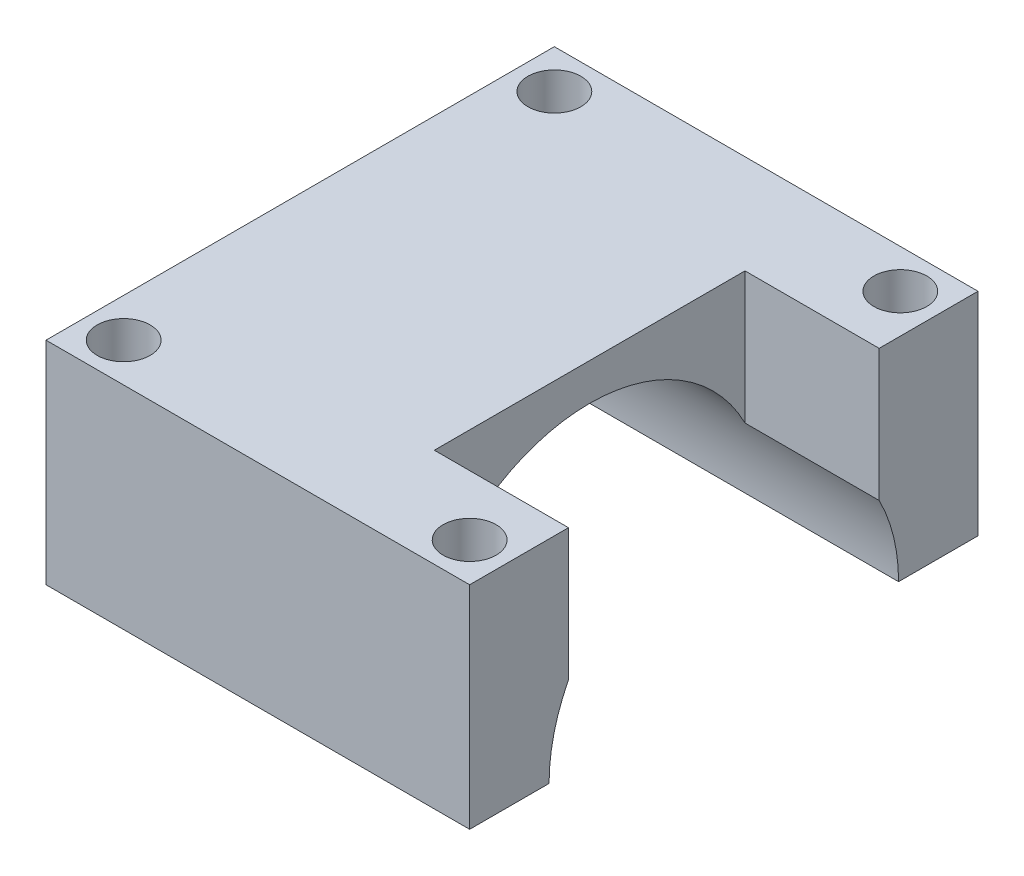
ISO-10303-21;
HEADER;
FILE_DESCRIPTION(('STEP AP214'),'2;1');
FILE_NAME('part.step','',(''),(''),'','','');
FILE_SCHEMA(('AUTOMOTIVE_DESIGN { 1 0 10303 214 1 1 1 1 }'));
ENDSEC;
DATA;
#1=APPLICATION_CONTEXT('core data for automotive mechanical design processes');
#2=APPLICATION_PROTOCOL_DEFINITION('international standard','automotive_design',2000,#1);
#3=PRODUCT_CONTEXT('',#1,'mechanical');
#4=PRODUCT('Part','Part','',(#3));
#5=PRODUCT_RELATED_PRODUCT_CATEGORY('part','',(#4));
#6=PRODUCT_DEFINITION_FORMATION('','',#4);
#7=PRODUCT_DEFINITION_CONTEXT('part definition',#1,'design');
#8=PRODUCT_DEFINITION('design','',#6,#7);
#9=PRODUCT_DEFINITION_SHAPE('','',#8);
#10=(LENGTH_UNIT() NAMED_UNIT(*) SI_UNIT(.MILLI.,.METRE.));
#11=(NAMED_UNIT(*) PLANE_ANGLE_UNIT() SI_UNIT($,.RADIAN.));
#12=(NAMED_UNIT(*) SI_UNIT($,.STERADIAN.) SOLID_ANGLE_UNIT());
#13=UNCERTAINTY_MEASURE_WITH_UNIT(LENGTH_MEASURE(1.E-05),#10,'distance_accuracy_value','');
#14=(GEOMETRIC_REPRESENTATION_CONTEXT(3) GLOBAL_UNCERTAINTY_ASSIGNED_CONTEXT((#13)) GLOBAL_UNIT_ASSIGNED_CONTEXT((#10,
#11,#12)) REPRESENTATION_CONTEXT('',''));
#15=CARTESIAN_POINT('',(0.,0.,0.));
#16=DIRECTION('',(0.,0.,1.));
#17=DIRECTION('',(1.,0.,0.));
#18=AXIS2_PLACEMENT_3D('',#15,#16,#17);
#19=CARTESIAN_POINT('',(15.,30.,18.));
#20=DIRECTION('',(-1.,0.,0.));
#21=DIRECTION('',(0.,0.,1.));
#22=AXIS2_PLACEMENT_3D('',#19,#20,#21);
#23=PLANE('',#22);
#24=DIRECTION('',(0.,0.,-1.));
#25=VECTOR('',#24,1.);
#26=CARTESIAN_POINT('',(15.,30.,18.));
#27=LINE('',#26,#25);
#28=CARTESIAN_POINT('',(15.,30.,-11.));
#29=VERTEX_POINT('',#28);
#30=CARTESIAN_POINT('',(15.,30.,-18.));
#31=VERTEX_POINT('',#30);
#32=EDGE_CURVE('E223',#29,#31,#27,.T.);
#33=ORIENTED_EDGE('',*,*,#32,.F.);
#34=DIRECTION('',(0.,1.,0.));
#35=VECTOR('',#34,1.);
#36=CARTESIAN_POINT('',(15.,20.,-11.));
#37=LINE('',#36,#35);
#38=CARTESIAN_POINT('',(15.,20.6692702352243,-11.));
#39=VERTEX_POINT('',#38);
#40=EDGE_CURVE('E142',#39,#29,#37,.T.);
#41=ORIENTED_EDGE('',*,*,#40,.F.);
#42=CARTESIAN_POINT('',(15.,15.,0.));
#43=DIRECTION('',(1.,0.,0.));
#44=DIRECTION('',(0.,0.,-1.));
#45=AXIS2_PLACEMENT_3D('',#42,#43,#44);
#46=CIRCLE('',#45,12.375);
#47=CARTESIAN_POINT('',(15.,15.,-12.375));
#48=VERTEX_POINT('',#47);
#49=EDGE_CURVE('E214',#48,#39,#46,.T.);
#50=ORIENTED_EDGE('',*,*,#49,.F.);
#51=DIRECTION('',(0.,0.,1.));
#52=VECTOR('',#51,1.);
#53=CARTESIAN_POINT('',(15.,15.,18.));
#54=LINE('',#53,#52);
#55=CARTESIAN_POINT('',(15.,15.,-18.));
#56=VERTEX_POINT('',#55);
#57=EDGE_CURVE('E168',#56,#48,#54,.T.);
#58=ORIENTED_EDGE('',*,*,#57,.F.);
#59=DIRECTION('',(0.,-1.,0.));
#60=VECTOR('',#59,1.);
#61=CARTESIAN_POINT('',(15.,30.,-18.));
#62=LINE('',#61,#60);
#63=EDGE_CURVE('E244',#31,#56,#62,.T.);
#64=ORIENTED_EDGE('',*,*,#63,.F.);
#65=EDGE_LOOP('',(#33,#41,#50,#58,#64));
#66=FACE_BOUND('',#65,.T.);
#67=ADVANCED_FACE('F49',(#66),#23,.F.);
#68=CARTESIAN_POINT('',(15.,20.6692702352243,11.));
#69=VERTEX_POINT('',#68);
#70=CARTESIAN_POINT('',(15.,15.,12.375));
#71=VERTEX_POINT('',#70);
#72=EDGE_CURVE('E213',#69,#71,#46,.T.);
#73=ORIENTED_EDGE('',*,*,#72,.F.);
#74=DIRECTION('',(0.,1.,0.));
#75=VECTOR('',#74,1.);
#76=CARTESIAN_POINT('',(15.,20.,11.));
#77=LINE('',#76,#75);
#78=CARTESIAN_POINT('',(15.,30.,11.));
#79=VERTEX_POINT('',#78);
#80=EDGE_CURVE('E157',#69,#79,#77,.T.);
#81=ORIENTED_EDGE('',*,*,#80,.T.);
#82=CARTESIAN_POINT('',(15.,30.,18.));
#83=VERTEX_POINT('',#82);
#84=EDGE_CURVE('E219',#83,#79,#27,.T.);
#85=ORIENTED_EDGE('',*,*,#84,.F.);
#86=DIRECTION('',(0.,-1.,0.));
#87=VECTOR('',#86,1.);
#88=CARTESIAN_POINT('',(15.,30.,18.));
#89=LINE('',#88,#87);
#90=CARTESIAN_POINT('',(15.,15.,18.));
#91=VERTEX_POINT('',#90);
#92=EDGE_CURVE('E232',#83,#91,#89,.T.);
#93=ORIENTED_EDGE('',*,*,#92,.T.);
#94=EDGE_CURVE('E156',#71,#91,#54,.T.);
#95=ORIENTED_EDGE('',*,*,#94,.F.);
#96=EDGE_LOOP('',(#73,#81,#85,#93,#95));
#97=FACE_BOUND('',#96,.T.);
#98=ADVANCED_FACE('F51',(#97),#23,.F.);
#99=CARTESIAN_POINT('',(-15.,30.,-18.));
#100=DIRECTION('',(0.,0.,1.));
#101=DIRECTION('',(1.,0.,0.));
#102=AXIS2_PLACEMENT_3D('',#99,#100,#101);
#103=PLANE('',#102);
#104=ORIENTED_EDGE('',*,*,#63,.T.);
#105=DIRECTION('',(1.,0.,0.));
#106=VECTOR('',#105,1.);
#107=CARTESIAN_POINT('',(-15.,15.,-18.));
#108=LINE('',#107,#106);
#109=CARTESIAN_POINT('',(-15.,15.,-18.));
#110=VERTEX_POINT('',#109);
#111=EDGE_CURVE('E171',#110,#56,#108,.T.);
#112=ORIENTED_EDGE('',*,*,#111,.F.);
#113=DIRECTION('',(0.,-1.,0.));
#114=VECTOR('',#113,1.);
#115=CARTESIAN_POINT('',(-15.,30.,-18.));
#116=LINE('',#115,#114);
#117=CARTESIAN_POINT('',(-15.,30.,-18.));
#118=VERTEX_POINT('',#117);
#119=EDGE_CURVE('E240',#118,#110,#116,.T.);
#120=ORIENTED_EDGE('',*,*,#119,.F.);
#121=DIRECTION('',(-1.,0.,0.));
#122=VECTOR('',#121,1.);
#123=CARTESIAN_POINT('',(-15.,30.,-18.));
#124=LINE('',#123,#122);
#125=EDGE_CURVE('E222',#31,#118,#124,.T.);
#126=ORIENTED_EDGE('',*,*,#125,.F.);
#127=EDGE_LOOP('',(#104,#112,#120,#126));
#128=FACE_BOUND('',#127,.T.);
#129=ADVANCED_FACE('F286',(#128),#103,.F.);
#130=CARTESIAN_POINT('',(-15.,30.,18.));
#131=DIRECTION('',(1.,0.,0.));
#132=DIRECTION('',(0.,0.,-1.));
#133=AXIS2_PLACEMENT_3D('',#130,#131,#132);
#134=PLANE('',#133);
#135=ORIENTED_EDGE('',*,*,#119,.T.);
#136=DIRECTION('',(0.,0.,1.));
#137=VECTOR('',#136,1.);
#138=CARTESIAN_POINT('',(-15.,15.,18.));
#139=LINE('',#138,#137);
#140=CARTESIAN_POINT('',(-15.,15.,-12.375));
#141=VERTEX_POINT('',#140);
#142=EDGE_CURVE('E163',#110,#141,#139,.T.);
#143=ORIENTED_EDGE('',*,*,#142,.T.);
#144=CARTESIAN_POINT('',(-15.,15.,0.));
#145=DIRECTION('',(1.,0.,0.));
#146=DIRECTION('',(0.,0.,-1.));
#147=AXIS2_PLACEMENT_3D('',#144,#145,#146);
#148=CIRCLE('',#147,12.375);
#149=CARTESIAN_POINT('',(-15.,15.,12.375));
#150=VERTEX_POINT('',#149);
#151=EDGE_CURVE('E218',#141,#150,#148,.T.);
#152=ORIENTED_EDGE('',*,*,#151,.T.);
#153=CARTESIAN_POINT('',(-15.,15.,18.));
#154=VERTEX_POINT('',#153);
#155=EDGE_CURVE('E73',#150,#154,#139,.T.);
#156=ORIENTED_EDGE('',*,*,#155,.T.);
#157=DIRECTION('',(0.,-1.,0.));
#158=VECTOR('',#157,1.);
#159=CARTESIAN_POINT('',(-15.,30.,18.));
#160=LINE('',#159,#158);
#161=CARTESIAN_POINT('',(-15.,30.,18.));
#162=VERTEX_POINT('',#161);
#163=EDGE_CURVE('E236',#162,#154,#160,.T.);
#164=ORIENTED_EDGE('',*,*,#163,.F.);
#165=DIRECTION('',(0.,0.,1.));
#166=VECTOR('',#165,1.);
#167=CARTESIAN_POINT('',(-15.,30.,18.));
#168=LINE('',#167,#166);
#169=EDGE_CURVE('E226',#118,#162,#168,.T.);
#170=ORIENTED_EDGE('',*,*,#169,.F.);
#171=EDGE_LOOP('',(#135,#143,#152,#156,#164,#170));
#172=FACE_BOUND('',#171,.T.);
#173=ADVANCED_FACE('F277',(#172),#134,.F.);
#174=CARTESIAN_POINT('',(-15.,30.,18.));
#175=DIRECTION('',(0.,0.,-1.));
#176=DIRECTION('',(-1.,0.,0.));
#177=AXIS2_PLACEMENT_3D('',#174,#175,#176);
#178=PLANE('',#177);
#179=ORIENTED_EDGE('',*,*,#163,.T.);
#180=DIRECTION('',(1.,0.,0.));
#181=VECTOR('',#180,1.);
#182=CARTESIAN_POINT('',(-15.,15.,18.));
#183=LINE('',#182,#181);
#184=EDGE_CURVE('E167',#154,#91,#183,.T.);
#185=ORIENTED_EDGE('',*,*,#184,.T.);
#186=ORIENTED_EDGE('',*,*,#92,.F.);
#187=DIRECTION('',(1.,0.,0.));
#188=VECTOR('',#187,1.);
#189=CARTESIAN_POINT('',(-15.,30.,18.));
#190=LINE('',#189,#188);
#191=EDGE_CURVE('E229',#162,#83,#190,.T.);
#192=ORIENTED_EDGE('',*,*,#191,.F.);
#193=EDGE_LOOP('',(#179,#185,#186,#192));
#194=FACE_BOUND('',#193,.T.);
#195=ADVANCED_FACE('F270',(#194),#178,.F.);
#196=CARTESIAN_POINT('',(0.,30.,0.));
#197=DIRECTION('',(0.,-1.,0.));
#198=DIRECTION('',(0.,0.,-1.));
#199=AXIS2_PLACEMENT_3D('',#196,#197,#198);
#200=PLANE('',#199);
#201=CARTESIAN_POINT('',(12.25,30.,-15.25));
#202=DIRECTION('',(0.,1.,0.));
#203=DIRECTION('',(0.,0.,-1.));
#204=AXIS2_PLACEMENT_3D('',#201,#202,#203);
#205=CIRCLE('',#204,1.875);
#206=CARTESIAN_POINT('',(12.25,30.,-17.125));
#207=VERTEX_POINT('',#206);
#208=EDGE_CURVE('E197',#207,#207,#205,.T.);
#209=ORIENTED_EDGE('',*,*,#208,.F.);
#210=EDGE_LOOP('',(#209));
#211=FACE_BOUND('',#210,.T.);
#212=CARTESIAN_POINT('',(12.25,30.,15.25));
#213=DIRECTION('',(0.,1.,0.));
#214=DIRECTION('',(0.,0.,1.));
#215=AXIS2_PLACEMENT_3D('',#212,#213,#214);
#216=CIRCLE('',#215,1.875);
#217=CARTESIAN_POINT('',(12.25,30.,17.125));
#218=VERTEX_POINT('',#217);
#219=EDGE_CURVE('E203',#218,#218,#216,.T.);
#220=ORIENTED_EDGE('',*,*,#219,.F.);
#221=EDGE_LOOP('',(#220));
#222=FACE_BOUND('',#221,.T.);
#223=CARTESIAN_POINT('',(-12.25,30.,15.25));
#224=DIRECTION('',(0.,1.,0.));
#225=DIRECTION('',(0.,0.,-1.));
#226=AXIS2_PLACEMENT_3D('',#223,#224,#225);
#227=CIRCLE('',#226,1.875);
#228=CARTESIAN_POINT('',(-12.25,30.,13.375));
#229=VERTEX_POINT('',#228);
#230=EDGE_CURVE('E198',#229,#229,#227,.T.);
#231=ORIENTED_EDGE('',*,*,#230,.F.);
#232=EDGE_LOOP('',(#231));
#233=FACE_BOUND('',#232,.T.);
#234=CARTESIAN_POINT('',(-12.25,30.,-15.25));
#235=DIRECTION('',(0.,1.,0.));
#236=DIRECTION('',(0.,0.,1.));
#237=AXIS2_PLACEMENT_3D('',#234,#235,#236);
#238=CIRCLE('',#237,1.875);
#239=CARTESIAN_POINT('',(-12.25,30.,-13.375));
#240=VERTEX_POINT('',#239);
#241=EDGE_CURVE('E202',#240,#240,#238,.T.);
#242=ORIENTED_EDGE('',*,*,#241,.F.);
#243=EDGE_LOOP('',(#242));
#244=FACE_BOUND('',#243,.T.);
#245=DIRECTION('',(0.,0.,1.));
#246=VECTOR('',#245,1.);
#247=CARTESIAN_POINT('',(5.5,30.,11.));
#248=LINE('',#247,#246);
#249=CARTESIAN_POINT('',(5.5,30.,-11.));
#250=VERTEX_POINT('',#249);
#251=CARTESIAN_POINT('',(5.5,30.,11.));
#252=VERTEX_POINT('',#251);
#253=EDGE_CURVE('E130',#250,#252,#248,.T.);
#254=ORIENTED_EDGE('',*,*,#253,.F.);
#255=DIRECTION('',(-1.,0.,0.));
#256=VECTOR('',#255,1.);
#257=CARTESIAN_POINT('',(5.5,30.,-11.));
#258=LINE('',#257,#256);
#259=EDGE_CURVE('E139',#29,#250,#258,.T.);
#260=ORIENTED_EDGE('',*,*,#259,.F.);
#261=ORIENTED_EDGE('',*,*,#32,.T.);
#262=ORIENTED_EDGE('',*,*,#125,.T.);
#263=ORIENTED_EDGE('',*,*,#169,.T.);
#264=ORIENTED_EDGE('',*,*,#191,.T.);
#265=ORIENTED_EDGE('',*,*,#84,.T.);
#266=DIRECTION('',(1.,0.,0.));
#267=VECTOR('',#266,1.);
#268=CARTESIAN_POINT('',(5.5,30.,11.));
#269=LINE('',#268,#267);
#270=EDGE_CURVE('E136',#252,#79,#269,.T.);
#271=ORIENTED_EDGE('',*,*,#270,.F.);
#272=EDGE_LOOP('',(#254,#260,#261,#262,#263,#264,#265,#271));
#273=FACE_BOUND('',#272,.T.);
#274=ADVANCED_FACE('F147',(#211,#222,#233,#244,#273),#200,.F.);
#275=CARTESIAN_POINT('',(-25.,15.,0.));
#276=DIRECTION('',(1.,0.,0.));
#277=DIRECTION('',(0.,0.,-1.));
#278=AXIS2_PLACEMENT_3D('',#275,#276,#277);
#279=CYLINDRICAL_SURFACE('',#278,12.375);
#280=ORIENTED_EDGE('',*,*,#49,.T.);
#281=DIRECTION('',(1.,0.,0.));
#282=VECTOR('',#281,1.);
#283=CARTESIAN_POINT('',(-25.,20.6692702352243,-11.));
#284=LINE('',#283,#282);
#285=CARTESIAN_POINT('',(5.5,20.6692702352243,-11.));
#286=VERTEX_POINT('',#285);
#287=EDGE_CURVE('E11',#39,#286,#284,.F.);
#288=ORIENTED_EDGE('',*,*,#287,.T.);
#289=CARTESIAN_POINT('',(5.5,15.,0.));
#290=DIRECTION('',(-1.,0.,0.));
#291=DIRECTION('',(0.,0.,1.));
#292=AXIS2_PLACEMENT_3D('',#289,#290,#291);
#293=CIRCLE('',#292,12.375);
#294=CARTESIAN_POINT('',(5.5,20.6692702352243,11.));
#295=VERTEX_POINT('',#294);
#296=EDGE_CURVE('E133',#286,#295,#293,.F.);
#297=ORIENTED_EDGE('',*,*,#296,.T.);
#298=DIRECTION('',(1.,0.,0.));
#299=VECTOR('',#298,1.);
#300=CARTESIAN_POINT('',(-25.,20.6692702352243,11.));
#301=LINE('',#300,#299);
#302=EDGE_CURVE('E58',#295,#69,#301,.T.);
#303=ORIENTED_EDGE('',*,*,#302,.T.);
#304=ORIENTED_EDGE('',*,*,#72,.T.);
#305=DIRECTION('',(1.,0.,0.));
#306=VECTOR('',#305,1.);
#307=CARTESIAN_POINT('',(-25.,15.,12.375));
#308=LINE('',#307,#306);
#309=EDGE_CURVE('E194',#71,#150,#308,.F.);
#310=ORIENTED_EDGE('',*,*,#309,.T.);
#311=ORIENTED_EDGE('',*,*,#151,.F.);
#312=DIRECTION('',(1.,0.,0.));
#313=VECTOR('',#312,1.);
#314=CARTESIAN_POINT('',(-25.,15.,-12.375));
#315=LINE('',#314,#313);
#316=EDGE_CURVE('E190',#141,#48,#315,.T.);
#317=ORIENTED_EDGE('',*,*,#316,.T.);
#318=EDGE_LOOP('',(#280,#288,#297,#303,#304,#310,#311,#317));
#319=FACE_BOUND('',#318,.T.);
#320=ADVANCED_FACE('F259',(#319),#279,.F.);
#321=CARTESIAN_POINT('',(-12.25,-10.,-15.25));
#322=DIRECTION('',(0.,1.,0.));
#323=DIRECTION('',(0.,0.,1.));
#324=AXIS2_PLACEMENT_3D('',#321,#322,#323);
#325=CYLINDRICAL_SURFACE('',#324,1.875);
#326=CARTESIAN_POINT('',(-12.25,15.,-15.25));
#327=DIRECTION('',(0.,1.,0.));
#328=DIRECTION('',(0.,0.,1.));
#329=AXIS2_PLACEMENT_3D('',#326,#327,#328);
#330=CIRCLE('',#329,1.875);
#331=CARTESIAN_POINT('',(-12.25,15.,-13.375));
#332=VERTEX_POINT('',#331);
#333=EDGE_CURVE('E186',#332,#332,#330,.F.);
#334=ORIENTED_EDGE('',*,*,#333,.T.);
#335=EDGE_LOOP('',(#334));
#336=FACE_BOUND('',#335,.T.);
#337=ORIENTED_EDGE('',*,*,#241,.T.);
#338=EDGE_LOOP('',(#337));
#339=FACE_BOUND('',#338,.T.);
#340=ADVANCED_FACE('F324',(#336,#339),#325,.F.);
#341=CARTESIAN_POINT('',(-12.25,-10.,15.25));
#342=DIRECTION('',(0.,1.,0.));
#343=DIRECTION('',(0.,0.,1.));
#344=AXIS2_PLACEMENT_3D('',#341,#342,#343);
#345=CYLINDRICAL_SURFACE('',#344,1.875);
#346=CARTESIAN_POINT('',(-12.25,15.,15.25));
#347=DIRECTION('',(0.,1.,0.));
#348=DIRECTION('',(0.,0.,1.));
#349=AXIS2_PLACEMENT_3D('',#346,#347,#348);
#350=CIRCLE('',#349,1.875);
#351=CARTESIAN_POINT('',(-12.25,15.,17.125));
#352=VERTEX_POINT('',#351);
#353=EDGE_CURVE('E182',#352,#352,#350,.F.);
#354=ORIENTED_EDGE('',*,*,#353,.T.);
#355=EDGE_LOOP('',(#354));
#356=FACE_BOUND('',#355,.T.);
#357=ORIENTED_EDGE('',*,*,#230,.T.);
#358=EDGE_LOOP('',(#357));
#359=FACE_BOUND('',#358,.T.);
#360=ADVANCED_FACE('F326',(#356,#359),#345,.F.);
#361=CARTESIAN_POINT('',(12.25,-10.,15.25));
#362=DIRECTION('',(0.,1.,0.));
#363=DIRECTION('',(0.,0.,1.));
#364=AXIS2_PLACEMENT_3D('',#361,#362,#363);
#365=CYLINDRICAL_SURFACE('',#364,1.875);
#366=CARTESIAN_POINT('',(12.25,15.,15.25));
#367=DIRECTION('',(0.,1.,0.));
#368=DIRECTION('',(0.,0.,1.));
#369=AXIS2_PLACEMENT_3D('',#366,#367,#368);
#370=CIRCLE('',#369,1.875);
#371=CARTESIAN_POINT('',(12.25,15.,17.125));
#372=VERTEX_POINT('',#371);
#373=EDGE_CURVE('E178',#372,#372,#370,.F.);
#374=ORIENTED_EDGE('',*,*,#373,.T.);
#375=EDGE_LOOP('',(#374));
#376=FACE_BOUND('',#375,.T.);
#377=ORIENTED_EDGE('',*,*,#219,.T.);
#378=EDGE_LOOP('',(#377));
#379=FACE_BOUND('',#378,.T.);
#380=ADVANCED_FACE('F298',(#376,#379),#365,.F.);
#381=CARTESIAN_POINT('',(12.25,-10.,-15.25));
#382=DIRECTION('',(0.,1.,0.));
#383=DIRECTION('',(0.,0.,1.));
#384=AXIS2_PLACEMENT_3D('',#381,#382,#383);
#385=CYLINDRICAL_SURFACE('',#384,1.875);
#386=CARTESIAN_POINT('',(12.25,15.,-15.25));
#387=DIRECTION('',(0.,1.,0.));
#388=DIRECTION('',(0.,0.,1.));
#389=AXIS2_PLACEMENT_3D('',#386,#387,#388);
#390=CIRCLE('',#389,1.875);
#391=CARTESIAN_POINT('',(12.25,15.,-13.375));
#392=VERTEX_POINT('',#391);
#393=EDGE_CURVE('E174',#392,#392,#390,.F.);
#394=ORIENTED_EDGE('',*,*,#393,.T.);
#395=EDGE_LOOP('',(#394));
#396=FACE_BOUND('',#395,.T.);
#397=ORIENTED_EDGE('',*,*,#208,.T.);
#398=EDGE_LOOP('',(#397));
#399=FACE_BOUND('',#398,.T.);
#400=ADVANCED_FACE('F290',(#396,#399),#385,.F.);
#401=CARTESIAN_POINT('',(-15.,15.,18.));
#402=DIRECTION('',(0.,1.,0.));
#403=DIRECTION('',(0.,0.,1.));
#404=AXIS2_PLACEMENT_3D('',#401,#402,#403);
#405=PLANE('',#404);
#406=ORIENTED_EDGE('',*,*,#333,.F.);
#407=EDGE_LOOP('',(#406));
#408=FACE_BOUND('',#407,.T.);
#409=ORIENTED_EDGE('',*,*,#393,.F.);
#410=EDGE_LOOP('',(#409));
#411=FACE_BOUND('',#410,.T.);
#412=ORIENTED_EDGE('',*,*,#142,.F.);
#413=ORIENTED_EDGE('',*,*,#111,.T.);
#414=ORIENTED_EDGE('',*,*,#57,.T.);
#415=ORIENTED_EDGE('',*,*,#316,.F.);
#416=EDGE_LOOP('',(#412,#413,#414,#415));
#417=FACE_BOUND('',#416,.T.);
#418=ADVANCED_FACE('F288',(#408,#411,#417),#405,.F.);
#419=ORIENTED_EDGE('',*,*,#353,.F.);
#420=EDGE_LOOP('',(#419));
#421=FACE_BOUND('',#420,.T.);
#422=ORIENTED_EDGE('',*,*,#373,.F.);
#423=EDGE_LOOP('',(#422));
#424=FACE_BOUND('',#423,.T.);
#425=ORIENTED_EDGE('',*,*,#94,.T.);
#426=ORIENTED_EDGE('',*,*,#184,.F.);
#427=ORIENTED_EDGE('',*,*,#155,.F.);
#428=ORIENTED_EDGE('',*,*,#309,.F.);
#429=EDGE_LOOP('',(#425,#426,#427,#428));
#430=FACE_BOUND('',#429,.T.);
#431=ADVANCED_FACE('F267',(#421,#424,#430),#405,.F.);
#432=CARTESIAN_POINT('',(5.5,20.,-11.));
#433=DIRECTION('',(0.,0.,-1.));
#434=DIRECTION('',(-1.,0.,0.));
#435=AXIS2_PLACEMENT_3D('',#432,#433,#434);
#436=PLANE('',#435);
#437=ORIENTED_EDGE('',*,*,#40,.T.);
#438=ORIENTED_EDGE('',*,*,#259,.T.);
#439=DIRECTION('',(0.,1.,0.));
#440=VECTOR('',#439,1.);
#441=CARTESIAN_POINT('',(5.5,20.,-11.));
#442=LINE('',#441,#440);
#443=EDGE_CURVE('E126',#286,#250,#442,.T.);
#444=ORIENTED_EDGE('',*,*,#443,.F.);
#445=ORIENTED_EDGE('',*,*,#287,.F.);
#446=EDGE_LOOP('',(#437,#438,#444,#445));
#447=FACE_BOUND('',#446,.T.);
#448=ADVANCED_FACE('F140',(#447),#436,.F.);
#449=CARTESIAN_POINT('',(5.5,20.,11.));
#450=DIRECTION('',(0.,0.,1.));
#451=DIRECTION('',(1.,0.,0.));
#452=AXIS2_PLACEMENT_3D('',#449,#450,#451);
#453=PLANE('',#452);
#454=DIRECTION('',(0.,1.,0.));
#455=VECTOR('',#454,1.);
#456=CARTESIAN_POINT('',(5.5,20.,11.));
#457=LINE('',#456,#455);
#458=EDGE_CURVE('E65',#295,#252,#457,.T.);
#459=ORIENTED_EDGE('',*,*,#458,.T.);
#460=ORIENTED_EDGE('',*,*,#270,.T.);
#461=ORIENTED_EDGE('',*,*,#80,.F.);
#462=ORIENTED_EDGE('',*,*,#302,.F.);
#463=EDGE_LOOP('',(#459,#460,#461,#462));
#464=FACE_BOUND('',#463,.T.);
#465=ADVANCED_FACE('F386',(#464),#453,.F.);
#466=CARTESIAN_POINT('',(5.5,20.,11.));
#467=DIRECTION('',(-1.,0.,0.));
#468=DIRECTION('',(0.,0.,1.));
#469=AXIS2_PLACEMENT_3D('',#466,#467,#468);
#470=PLANE('',#469);
#471=ORIENTED_EDGE('',*,*,#443,.T.);
#472=ORIENTED_EDGE('',*,*,#253,.T.);
#473=ORIENTED_EDGE('',*,*,#458,.F.);
#474=ORIENTED_EDGE('',*,*,#296,.F.);
#475=EDGE_LOOP('',(#471,#472,#473,#474));
#476=FACE_BOUND('',#475,.T.);
#477=ADVANCED_FACE('F128',(#476),#470,.F.);
#478=CLOSED_SHELL('',(#67,#98,#129,#173,#195,#274,#320,#340,#360,#380,#400,#418,#431,#448,#465,#477));
#479=MANIFOLD_SOLID_BREP('B2',#478);
#480=ADVANCED_BREP_SHAPE_REPRESENTATION('',(#18,#479),#14);
#481=SHAPE_DEFINITION_REPRESENTATION(#9,#480);
ENDSEC;
END-ISO-10303-21;
